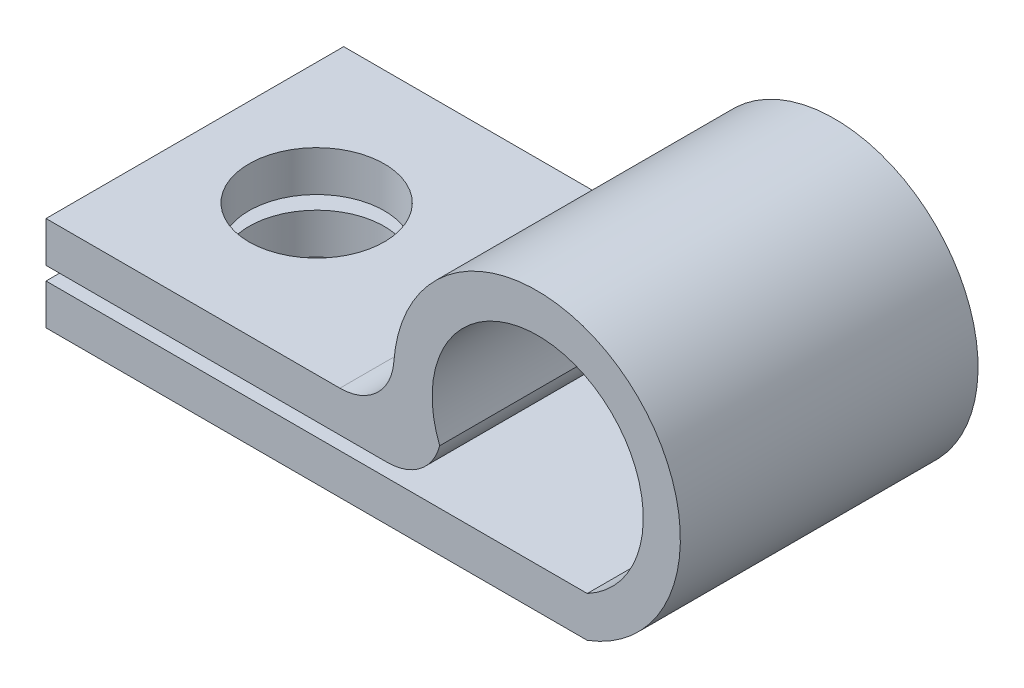
ISO-10303-21;
HEADER;
FILE_DESCRIPTION(('STEP AP214'),'2;1');
FILE_NAME('part.step','',(''),(''),'','','');
FILE_SCHEMA(('AUTOMOTIVE_DESIGN { 1 0 10303 214 1 1 1 1 }'));
ENDSEC;
DATA;
#1=APPLICATION_CONTEXT('core data for automotive mechanical design processes');
#2=APPLICATION_PROTOCOL_DEFINITION('international standard','automotive_design',2000,#1);
#3=PRODUCT_CONTEXT('',#1,'mechanical');
#4=PRODUCT('Part','Part','',(#3));
#5=PRODUCT_RELATED_PRODUCT_CATEGORY('part','',(#4));
#6=PRODUCT_DEFINITION_FORMATION('','',#4);
#7=PRODUCT_DEFINITION_CONTEXT('part definition',#1,'design');
#8=PRODUCT_DEFINITION('design','',#6,#7);
#9=PRODUCT_DEFINITION_SHAPE('','',#8);
#10=(LENGTH_UNIT() NAMED_UNIT(*) SI_UNIT(.MILLI.,.METRE.));
#11=(NAMED_UNIT(*) PLANE_ANGLE_UNIT() SI_UNIT($,.RADIAN.));
#12=(NAMED_UNIT(*) SI_UNIT($,.STERADIAN.) SOLID_ANGLE_UNIT());
#13=UNCERTAINTY_MEASURE_WITH_UNIT(LENGTH_MEASURE(1.E-05),#10,'distance_accuracy_value','');
#14=(GEOMETRIC_REPRESENTATION_CONTEXT(3) GLOBAL_UNCERTAINTY_ASSIGNED_CONTEXT((#13)) GLOBAL_UNIT_ASSIGNED_CONTEXT((#10,
#11,#12)) REPRESENTATION_CONTEXT('',''));
#15=CARTESIAN_POINT('',(0.,0.,0.));
#16=DIRECTION('',(0.,0.,1.));
#17=DIRECTION('',(1.,0.,0.));
#18=AXIS2_PLACEMENT_3D('',#15,#16,#17);
#19=CARTESIAN_POINT('',(0.,2.,11.));
#20=DIRECTION('',(0.,1.,0.));
#21=DIRECTION('',(0.,0.,1.));
#22=AXIS2_PLACEMENT_3D('',#19,#20,#21);
#23=PLANE('',#22);
#24=CARTESIAN_POINT('',(-15.5,2.,5.5));
#25=DIRECTION('',(0.,1.,0.));
#26=DIRECTION('',(0.,0.,1.));
#27=AXIS2_PLACEMENT_3D('',#24,#25,#26);
#28=CIRCLE('',#27,2.5);
#29=CARTESIAN_POINT('',(-15.5,2.,8.));
#30=VERTEX_POINT('',#29);
#31=EDGE_CURVE('E211',#30,#30,#28,.T.);
#32=ORIENTED_EDGE('',*,*,#31,.T.);
#33=EDGE_LOOP('',(#32));
#34=FACE_BOUND('',#33,.T.);
#35=DIRECTION('',(1.,0.,0.));
#36=VECTOR('',#35,1.);
#37=CARTESIAN_POINT('',(0.,2.,0.));
#38=LINE('',#37,#36);
#39=CARTESIAN_POINT('',(-20.,2.,0.));
#40=VERTEX_POINT('',#39);
#41=CARTESIAN_POINT('',(-7.39029966919305,2.,0.));
#42=VERTEX_POINT('',#41);
#43=EDGE_CURVE('E209',#40,#42,#38,.T.);
#44=ORIENTED_EDGE('',*,*,#43,.T.);
#45=DIRECTION('',(0.,0.,-1.));
#46=VECTOR('',#45,1.);
#47=CARTESIAN_POINT('',(-7.39029966919305,2.,11.));
#48=LINE('',#47,#46);
#49=CARTESIAN_POINT('',(-7.39029966919305,2.,11.));
#50=VERTEX_POINT('',#49);
#51=EDGE_CURVE('E43',#42,#50,#48,.F.);
#52=ORIENTED_EDGE('',*,*,#51,.T.);
#53=DIRECTION('',(1.,0.,0.));
#54=VECTOR('',#53,1.);
#55=CARTESIAN_POINT('',(0.,2.,11.));
#56=LINE('',#55,#54);
#57=CARTESIAN_POINT('',(-20.,2.,11.));
#58=VERTEX_POINT('',#57);
#59=EDGE_CURVE('E116',#58,#50,#56,.T.);
#60=ORIENTED_EDGE('',*,*,#59,.F.);
#61=DIRECTION('',(0.,0.,-1.));
#62=VECTOR('',#61,1.);
#63=CARTESIAN_POINT('',(-20.,2.,11.));
#64=LINE('',#63,#62);
#65=EDGE_CURVE('E187',#58,#40,#64,.T.);
#66=ORIENTED_EDGE('',*,*,#65,.T.);
#67=EDGE_LOOP('',(#44,#52,#60,#66));
#68=FACE_BOUND('',#67,.T.);
#69=ADVANCED_FACE('F35',(#34,#68),#23,.F.);
#70=CARTESIAN_POINT('',(-1.83080911439804,4.94356472084337,11.));
#71=DIRECTION('',(0.,0.,-1.));
#72=DIRECTION('',(-1.,0.,0.));
#73=AXIS2_PLACEMENT_3D('',#70,#71,#72);
#74=CYLINDRICAL_SURFACE('',#73,3.9);
#75=CARTESIAN_POINT('',(-1.83080911439804,4.94356472084337,0.));
#76=DIRECTION('',(0.,0.,1.));
#77=DIRECTION('',(1.,0.,0.));
#78=AXIS2_PLACEMENT_3D('',#75,#76,#77);
#79=CIRCLE('',#78,3.9);
#80=CARTESIAN_POINT('',(-5.45380799608934,3.5,0.));
#81=VERTEX_POINT('',#80);
#82=CARTESIAN_POINT('',(0.,1.5,0.));
#83=VERTEX_POINT('',#82);
#84=EDGE_CURVE('E205',#81,#83,#79,.F.);
#85=ORIENTED_EDGE('',*,*,#84,.T.);
#86=DIRECTION('',(0.,0.,-1.));
#87=VECTOR('',#86,1.);
#88=CARTESIAN_POINT('',(0.,1.5,11.));
#89=LINE('',#88,#87);
#90=CARTESIAN_POINT('',(0.,1.5,11.));
#91=VERTEX_POINT('',#90);
#92=EDGE_CURVE('E124',#91,#83,#89,.T.);
#93=ORIENTED_EDGE('',*,*,#92,.F.);
#94=CARTESIAN_POINT('',(-1.83080911439804,4.94356472084337,11.));
#95=DIRECTION('',(0.,0.,1.));
#96=DIRECTION('',(1.,0.,0.));
#97=AXIS2_PLACEMENT_3D('',#94,#95,#96);
#98=CIRCLE('',#97,3.9);
#99=CARTESIAN_POINT('',(-5.45380799608934,3.5,11.));
#100=VERTEX_POINT('',#99);
#101=EDGE_CURVE('E113',#100,#91,#98,.F.);
#102=ORIENTED_EDGE('',*,*,#101,.F.);
#103=DIRECTION('',(0.,0.,-1.));
#104=VECTOR('',#103,1.);
#105=CARTESIAN_POINT('',(-5.45380799608934,3.5,11.));
#106=LINE('',#105,#104);
#107=EDGE_CURVE('E122',#100,#81,#106,.T.);
#108=ORIENTED_EDGE('',*,*,#107,.T.);
#109=EDGE_LOOP('',(#85,#93,#102,#108));
#110=FACE_BOUND('',#109,.T.);
#111=ADVANCED_FACE('F121',(#110),#74,.F.);
#112=CARTESIAN_POINT('',(0.,1.5,11.));
#113=DIRECTION('',(0.,-1.,0.));
#114=DIRECTION('',(1.,0.,0.));
#115=AXIS2_PLACEMENT_3D('',#112,#113,#114);
#116=PLANE('',#115);
#117=CARTESIAN_POINT('',(-15.5,1.5,5.5));
#118=DIRECTION('',(0.,-1.,0.));
#119=DIRECTION('',(1.,0.,0.));
#120=AXIS2_PLACEMENT_3D('',#117,#118,#119);
#121=CIRCLE('',#120,2.5);
#122=CARTESIAN_POINT('',(-13.,1.5,5.5));
#123=VERTEX_POINT('',#122);
#124=EDGE_CURVE('E139',#123,#123,#121,.T.);
#125=ORIENTED_EDGE('',*,*,#124,.T.);
#126=EDGE_LOOP('',(#125));
#127=FACE_BOUND('',#126,.T.);
#128=DIRECTION('',(-1.,0.,0.));
#129=VECTOR('',#128,1.);
#130=CARTESIAN_POINT('',(0.,1.5,0.));
#131=LINE('',#130,#129);
#132=CARTESIAN_POINT('',(-20.,1.5,0.));
#133=VERTEX_POINT('',#132);
#134=EDGE_CURVE('E203',#83,#133,#131,.T.);
#135=ORIENTED_EDGE('',*,*,#134,.T.);
#136=DIRECTION('',(0.,0.,-1.));
#137=VECTOR('',#136,1.);
#138=CARTESIAN_POINT('',(-20.,1.5,11.));
#139=LINE('',#138,#137);
#140=CARTESIAN_POINT('',(-20.,1.5,11.));
#141=VERTEX_POINT('',#140);
#142=EDGE_CURVE('E133',#141,#133,#139,.T.);
#143=ORIENTED_EDGE('',*,*,#142,.F.);
#144=DIRECTION('',(-1.,0.,0.));
#145=VECTOR('',#144,1.);
#146=CARTESIAN_POINT('',(0.,1.5,11.));
#147=LINE('',#146,#145);
#148=EDGE_CURVE('E126',#91,#141,#147,.T.);
#149=ORIENTED_EDGE('',*,*,#148,.F.);
#150=ORIENTED_EDGE('',*,*,#92,.T.);
#151=EDGE_LOOP('',(#135,#143,#149,#150));
#152=FACE_BOUND('',#151,.T.);
#153=ADVANCED_FACE('F204',(#127,#152),#116,.F.);
#154=CARTESIAN_POINT('',(-20.,0.,11.));
#155=DIRECTION('',(-1.,0.,0.));
#156=DIRECTION('',(0.,0.,1.));
#157=AXIS2_PLACEMENT_3D('',#154,#155,#156);
#158=PLANE('',#157);
#159=DIRECTION('',(0.,1.,0.));
#160=VECTOR('',#159,1.);
#161=CARTESIAN_POINT('',(-20.,0.,0.));
#162=LINE('',#161,#160);
#163=CARTESIAN_POINT('',(-20.,0.,0.));
#164=VERTEX_POINT('',#163);
#165=EDGE_CURVE('E182',#164,#133,#162,.T.);
#166=ORIENTED_EDGE('',*,*,#165,.F.);
#167=DIRECTION('',(0.,0.,-1.));
#168=VECTOR('',#167,1.);
#169=CARTESIAN_POINT('',(-20.,0.,11.));
#170=LINE('',#169,#168);
#171=CARTESIAN_POINT('',(-20.,0.,11.));
#172=VERTEX_POINT('',#171);
#173=EDGE_CURVE('E191',#172,#164,#170,.T.);
#174=ORIENTED_EDGE('',*,*,#173,.F.);
#175=DIRECTION('',(0.,1.,0.));
#176=VECTOR('',#175,1.);
#177=CARTESIAN_POINT('',(-20.,0.,11.));
#178=LINE('',#177,#176);
#179=EDGE_CURVE('E200',#172,#141,#178,.T.);
#180=ORIENTED_EDGE('',*,*,#179,.T.);
#181=ORIENTED_EDGE('',*,*,#142,.T.);
#182=EDGE_LOOP('',(#166,#174,#180,#181));
#183=FACE_BOUND('',#182,.T.);
#184=ADVANCED_FACE('F197',(#183),#158,.T.);
#185=CARTESIAN_POINT('',(0.,0.,11.));
#186=DIRECTION('',(0.,-1.,0.));
#187=DIRECTION('',(1.,0.,0.));
#188=AXIS2_PLACEMENT_3D('',#185,#186,#187);
#189=PLANE('',#188);
#190=CARTESIAN_POINT('',(-15.5,0.,5.5));
#191=DIRECTION('',(0.,-1.,0.));
#192=DIRECTION('',(1.,0.,0.));
#193=AXIS2_PLACEMENT_3D('',#190,#191,#192);
#194=CIRCLE('',#193,2.5);
#195=CARTESIAN_POINT('',(-13.,0.,5.5));
#196=VERTEX_POINT('',#195);
#197=EDGE_CURVE('E140',#196,#196,#194,.T.);
#198=ORIENTED_EDGE('',*,*,#197,.F.);
#199=EDGE_LOOP('',(#198));
#200=FACE_BOUND('',#199,.T.);
#201=DIRECTION('',(-1.,0.,0.));
#202=VECTOR('',#201,1.);
#203=CARTESIAN_POINT('',(0.,0.,0.));
#204=LINE('',#203,#202);
#205=CARTESIAN_POINT('',(0.,0.,0.));
#206=VERTEX_POINT('',#205);
#207=EDGE_CURVE('E178',#206,#164,#204,.T.);
#208=ORIENTED_EDGE('',*,*,#207,.F.);
#209=DIRECTION('',(0.,0.,-1.));
#210=VECTOR('',#209,1.);
#211=CARTESIAN_POINT('',(0.,0.,11.));
#212=LINE('',#211,#210);
#213=CARTESIAN_POINT('',(0.,0.,11.));
#214=VERTEX_POINT('',#213);
#215=EDGE_CURVE('E176',#214,#206,#212,.T.);
#216=ORIENTED_EDGE('',*,*,#215,.F.);
#217=DIRECTION('',(-1.,0.,0.));
#218=VECTOR('',#217,1.);
#219=CARTESIAN_POINT('',(0.,0.,11.));
#220=LINE('',#219,#218);
#221=EDGE_CURVE('E214',#214,#172,#220,.T.);
#222=ORIENTED_EDGE('',*,*,#221,.T.);
#223=ORIENTED_EDGE('',*,*,#173,.T.);
#224=EDGE_LOOP('',(#208,#216,#222,#223));
#225=FACE_BOUND('',#224,.T.);
#226=ADVANCED_FACE('F230',(#200,#225),#189,.T.);
#227=CARTESIAN_POINT('',(-1.85973089006571,4.96300322552136,11.));
#228=DIRECTION('',(0.,0.,-1.));
#229=DIRECTION('',(-1.,0.,0.));
#230=AXIS2_PLACEMENT_3D('',#227,#228,#229);
#231=CYLINDRICAL_SURFACE('',#230,5.3);
#232=CARTESIAN_POINT('',(-1.85973089006571,4.96300322552136,0.));
#233=DIRECTION('',(0.,0.,1.));
#234=DIRECTION('',(1.,0.,0.));
#235=AXIS2_PLACEMENT_3D('',#232,#233,#234);
#236=CIRCLE('',#235,5.3);
#237=CARTESIAN_POINT('',(-7.14537162466146,5.35287759603325,0.));
#238=VERTEX_POINT('',#237);
#239=EDGE_CURVE('E169',#238,#206,#236,.F.);
#240=ORIENTED_EDGE('',*,*,#239,.F.);
#241=DIRECTION('',(0.,0.,-1.));
#242=VECTOR('',#241,1.);
#243=CARTESIAN_POINT('',(-7.14537162466146,5.35287759603325,11.));
#244=LINE('',#243,#242);
#245=CARTESIAN_POINT('',(-7.14537162466146,5.35287759603325,11.));
#246=VERTEX_POINT('',#245);
#247=EDGE_CURVE('E131',#238,#246,#244,.F.);
#248=ORIENTED_EDGE('',*,*,#247,.T.);
#249=CARTESIAN_POINT('',(-1.85973089006571,4.96300322552136,11.));
#250=DIRECTION('',(0.,0.,1.));
#251=DIRECTION('',(1.,0.,0.));
#252=AXIS2_PLACEMENT_3D('',#249,#250,#251);
#253=CIRCLE('',#252,5.3);
#254=EDGE_CURVE('E154',#246,#214,#253,.F.);
#255=ORIENTED_EDGE('',*,*,#254,.T.);
#256=ORIENTED_EDGE('',*,*,#215,.T.);
#257=EDGE_LOOP('',(#240,#248,#255,#256));
#258=FACE_BOUND('',#257,.T.);
#259=ADVANCED_FACE('F174',(#258),#231,.T.);
#260=CARTESIAN_POINT('',(0.,3.5,11.));
#261=DIRECTION('',(0.,1.,0.));
#262=DIRECTION('',(0.,0.,1.));
#263=AXIS2_PLACEMENT_3D('',#260,#261,#262);
#264=PLANE('',#263);
#265=CARTESIAN_POINT('',(-15.5,3.5,5.5));
#266=DIRECTION('',(0.,1.,0.));
#267=DIRECTION('',(0.,0.,1.));
#268=AXIS2_PLACEMENT_3D('',#265,#266,#267);
#269=CIRCLE('',#268,2.5);
#270=CARTESIAN_POINT('',(-15.5,3.5,8.));
#271=VERTEX_POINT('',#270);
#272=EDGE_CURVE('E137',#271,#271,#269,.T.);
#273=ORIENTED_EDGE('',*,*,#272,.F.);
#274=EDGE_LOOP('',(#273));
#275=FACE_BOUND('',#274,.T.);
#276=DIRECTION('',(1.,0.,0.));
#277=VECTOR('',#276,1.);
#278=CARTESIAN_POINT('',(0.,3.5,11.));
#279=LINE('',#278,#277);
#280=CARTESIAN_POINT('',(-20.,3.5,11.));
#281=VERTEX_POINT('',#280);
#282=CARTESIAN_POINT('',(-9.13995303394288,3.5,11.));
#283=VERTEX_POINT('',#282);
#284=EDGE_CURVE('E151',#281,#283,#279,.T.);
#285=ORIENTED_EDGE('',*,*,#284,.T.);
#286=DIRECTION('',(0.,0.,1.));
#287=VECTOR('',#286,1.);
#288=CARTESIAN_POINT('',(-9.13995303394288,3.5,0.));
#289=LINE('',#288,#287);
#290=CARTESIAN_POINT('',(-9.13995303394288,3.5,0.));
#291=VERTEX_POINT('',#290);
#292=EDGE_CURVE('E128',#283,#291,#289,.F.);
#293=ORIENTED_EDGE('',*,*,#292,.T.);
#294=DIRECTION('',(1.,0.,0.));
#295=VECTOR('',#294,1.);
#296=CARTESIAN_POINT('',(0.,3.5,0.));
#297=LINE('',#296,#295);
#298=CARTESIAN_POINT('',(-20.,3.5,0.));
#299=VERTEX_POINT('',#298);
#300=EDGE_CURVE('E172',#299,#291,#297,.T.);
#301=ORIENTED_EDGE('',*,*,#300,.F.);
#302=DIRECTION('',(0.,0.,-1.));
#303=VECTOR('',#302,1.);
#304=CARTESIAN_POINT('',(-20.,3.5,11.));
#305=LINE('',#304,#303);
#306=EDGE_CURVE('E162',#281,#299,#305,.T.);
#307=ORIENTED_EDGE('',*,*,#306,.F.);
#308=EDGE_LOOP('',(#285,#293,#301,#307));
#309=FACE_BOUND('',#308,.T.);
#310=ADVANCED_FACE('F159',(#275,#309),#264,.T.);
#311=CARTESIAN_POINT('',(-20.,0.,11.));
#312=DIRECTION('',(-1.,0.,0.));
#313=DIRECTION('',(0.,0.,1.));
#314=AXIS2_PLACEMENT_3D('',#311,#312,#313);
#315=PLANE('',#314);
#316=DIRECTION('',(0.,1.,0.));
#317=VECTOR('',#316,1.);
#318=CARTESIAN_POINT('',(-20.,0.,0.));
#319=LINE('',#318,#317);
#320=EDGE_CURVE('E180',#40,#299,#319,.T.);
#321=ORIENTED_EDGE('',*,*,#320,.F.);
#322=ORIENTED_EDGE('',*,*,#65,.F.);
#323=DIRECTION('',(0.,1.,0.));
#324=VECTOR('',#323,1.);
#325=CARTESIAN_POINT('',(-20.,0.,11.));
#326=LINE('',#325,#324);
#327=EDGE_CURVE('E163',#58,#281,#326,.T.);
#328=ORIENTED_EDGE('',*,*,#327,.T.);
#329=ORIENTED_EDGE('',*,*,#306,.T.);
#330=EDGE_LOOP('',(#321,#322,#328,#329));
#331=FACE_BOUND('',#330,.T.);
#332=ADVANCED_FACE('F263',(#331),#315,.T.);
#333=CARTESIAN_POINT('',(0.,0.,11.));
#334=DIRECTION('',(0.,0.,1.));
#335=DIRECTION('',(1.,0.,0.));
#336=AXIS2_PLACEMENT_3D('',#333,#334,#335);
#337=PLANE('',#336);
#338=ORIENTED_EDGE('',*,*,#59,.T.);
#339=CARTESIAN_POINT('',(-7.39029966919305,4.,11.));
#340=DIRECTION('',(0.,0.,1.));
#341=DIRECTION('',(1.,0.,0.));
#342=AXIS2_PLACEMENT_3D('',#339,#340,#341);
#343=CIRCLE('',#342,2.);
#344=EDGE_CURVE('E11',#50,#100,#343,.T.);
#345=ORIENTED_EDGE('',*,*,#344,.T.);
#346=ORIENTED_EDGE('',*,*,#101,.T.);
#347=ORIENTED_EDGE('',*,*,#148,.T.);
#348=ORIENTED_EDGE('',*,*,#179,.F.);
#349=ORIENTED_EDGE('',*,*,#221,.F.);
#350=ORIENTED_EDGE('',*,*,#254,.F.);
#351=CARTESIAN_POINT('',(-9.13995303394288,5.5,11.));
#352=DIRECTION('',(0.,0.,1.));
#353=DIRECTION('',(1.,0.,0.));
#354=AXIS2_PLACEMENT_3D('',#351,#352,#353);
#355=CIRCLE('',#354,2.);
#356=EDGE_CURVE('E145',#246,#283,#355,.F.);
#357=ORIENTED_EDGE('',*,*,#356,.T.);
#358=ORIENTED_EDGE('',*,*,#284,.F.);
#359=ORIENTED_EDGE('',*,*,#327,.F.);
#360=EDGE_LOOP('',(#338,#345,#346,#347,#348,#349,#350,#357,#358,#359));
#361=FACE_BOUND('',#360,.T.);
#362=ADVANCED_FACE('F112',(#361),#337,.T.);
#363=CARTESIAN_POINT('',(0.,0.,0.));
#364=DIRECTION('',(0.,0.,1.));
#365=DIRECTION('',(1.,0.,0.));
#366=AXIS2_PLACEMENT_3D('',#363,#364,#365);
#367=PLANE('',#366);
#368=ORIENTED_EDGE('',*,*,#84,.F.);
#369=CARTESIAN_POINT('',(-7.39029966919305,4.,0.));
#370=DIRECTION('',(0.,0.,1.));
#371=DIRECTION('',(1.,0.,0.));
#372=AXIS2_PLACEMENT_3D('',#369,#370,#371);
#373=CIRCLE('',#372,2.);
#374=EDGE_CURVE('E57',#81,#42,#373,.F.);
#375=ORIENTED_EDGE('',*,*,#374,.T.);
#376=ORIENTED_EDGE('',*,*,#43,.F.);
#377=ORIENTED_EDGE('',*,*,#320,.T.);
#378=ORIENTED_EDGE('',*,*,#300,.T.);
#379=CARTESIAN_POINT('',(-9.13995303394288,5.5,0.));
#380=DIRECTION('',(0.,0.,1.));
#381=DIRECTION('',(1.,0.,0.));
#382=AXIS2_PLACEMENT_3D('',#379,#380,#381);
#383=CIRCLE('',#382,2.);
#384=EDGE_CURVE('E143',#291,#238,#383,.T.);
#385=ORIENTED_EDGE('',*,*,#384,.T.);
#386=ORIENTED_EDGE('',*,*,#239,.T.);
#387=ORIENTED_EDGE('',*,*,#207,.T.);
#388=ORIENTED_EDGE('',*,*,#165,.T.);
#389=ORIENTED_EDGE('',*,*,#134,.F.);
#390=EDGE_LOOP('',(#368,#375,#376,#377,#378,#385,#386,#387,#388,#389));
#391=FACE_BOUND('',#390,.T.);
#392=ADVANCED_FACE('F167',(#391),#367,.F.);
#393=CARTESIAN_POINT('',(-15.5,10.2630032255214,5.5));
#394=DIRECTION('',(0.,-1.,0.));
#395=DIRECTION('',(1.,0.,0.));
#396=AXIS2_PLACEMENT_3D('',#393,#394,#395);
#397=CYLINDRICAL_SURFACE('',#396,2.5);
#398=ORIENTED_EDGE('',*,*,#272,.T.);
#399=EDGE_LOOP('',(#398));
#400=FACE_BOUND('',#399,.T.);
#401=ORIENTED_EDGE('',*,*,#31,.F.);
#402=EDGE_LOOP('',(#401));
#403=FACE_BOUND('',#402,.T.);
#404=ADVANCED_FACE('F254',(#400,#403),#397,.F.);
#405=ORIENTED_EDGE('',*,*,#197,.T.);
#406=EDGE_LOOP('',(#405));
#407=FACE_BOUND('',#406,.T.);
#408=ORIENTED_EDGE('',*,*,#124,.F.);
#409=EDGE_LOOP('',(#408));
#410=FACE_BOUND('',#409,.T.);
#411=ADVANCED_FACE('F227',(#407,#410),#397,.F.);
#412=CARTESIAN_POINT('',(-9.13995303394288,5.5,11.));
#413=DIRECTION('',(0.,0.,-1.));
#414=DIRECTION('',(-1.,0.,0.));
#415=AXIS2_PLACEMENT_3D('',#412,#413,#414);
#416=CYLINDRICAL_SURFACE('',#415,2.);
#417=ORIENTED_EDGE('',*,*,#356,.F.);
#418=ORIENTED_EDGE('',*,*,#247,.F.);
#419=ORIENTED_EDGE('',*,*,#384,.F.);
#420=ORIENTED_EDGE('',*,*,#292,.F.);
#421=EDGE_LOOP('',(#417,#418,#419,#420));
#422=FACE_BOUND('',#421,.T.);
#423=ADVANCED_FACE('F165',(#422),#416,.F.);
#424=CARTESIAN_POINT('',(-7.39029966919305,4.,11.));
#425=DIRECTION('',(0.,0.,-1.));
#426=DIRECTION('',(-1.,0.,0.));
#427=AXIS2_PLACEMENT_3D('',#424,#425,#426);
#428=CYLINDRICAL_SURFACE('',#427,2.);
#429=ORIENTED_EDGE('',*,*,#344,.F.);
#430=ORIENTED_EDGE('',*,*,#51,.F.);
#431=ORIENTED_EDGE('',*,*,#374,.F.);
#432=ORIENTED_EDGE('',*,*,#107,.F.);
#433=EDGE_LOOP('',(#429,#430,#431,#432));
#434=FACE_BOUND('',#433,.T.);
#435=ADVANCED_FACE('F37',(#434),#428,.T.);
#436=CLOSED_SHELL('',(#69,#111,#153,#184,#226,#259,#310,#332,#362,#392,#404,#411,#423,#435));
#437=MANIFOLD_SOLID_BREP('B2',#436);
#438=ADVANCED_BREP_SHAPE_REPRESENTATION('',(#18,#437),#14);
#439=SHAPE_DEFINITION_REPRESENTATION(#9,#438);
ENDSEC;
END-ISO-10303-21;
